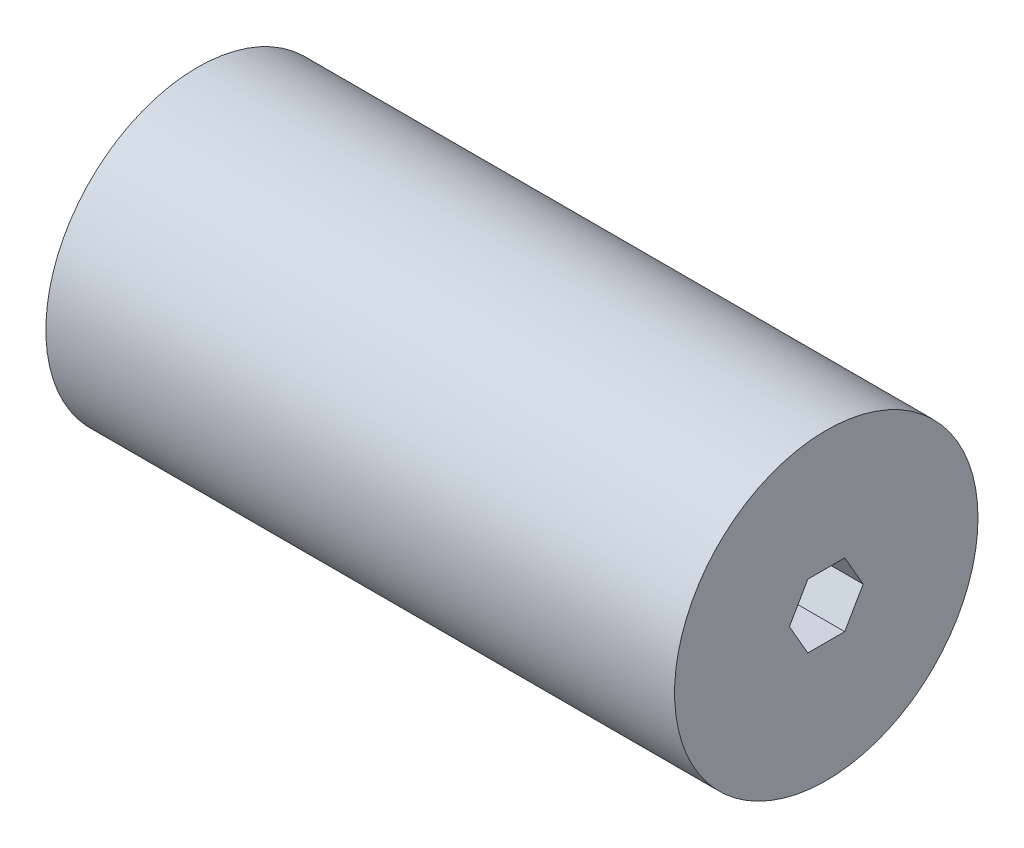
ISO-10303-21;
HEADER;
FILE_DESCRIPTION(('STEP AP214'),'2;1');
FILE_NAME('part.step','',(''),(''),'','','');
FILE_SCHEMA(('AUTOMOTIVE_DESIGN { 1 0 10303 214 1 1 1 1 }'));
ENDSEC;
DATA;
#1=APPLICATION_CONTEXT('core data for automotive mechanical design processes');
#2=APPLICATION_PROTOCOL_DEFINITION('international standard','automotive_design',2000,#1);
#3=PRODUCT_CONTEXT('',#1,'mechanical');
#4=PRODUCT('Part','Part','',(#3));
#5=PRODUCT_RELATED_PRODUCT_CATEGORY('part','',(#4));
#6=PRODUCT_DEFINITION_FORMATION('','',#4);
#7=PRODUCT_DEFINITION_CONTEXT('part definition',#1,'design');
#8=PRODUCT_DEFINITION('design','',#6,#7);
#9=PRODUCT_DEFINITION_SHAPE('','',#8);
#10=(LENGTH_UNIT() NAMED_UNIT(*) SI_UNIT(.MILLI.,.METRE.));
#11=(NAMED_UNIT(*) PLANE_ANGLE_UNIT() SI_UNIT($,.RADIAN.));
#12=(NAMED_UNIT(*) SI_UNIT($,.STERADIAN.) SOLID_ANGLE_UNIT());
#13=UNCERTAINTY_MEASURE_WITH_UNIT(LENGTH_MEASURE(1.E-05),#10,'distance_accuracy_value','');
#14=(GEOMETRIC_REPRESENTATION_CONTEXT(3) GLOBAL_UNCERTAINTY_ASSIGNED_CONTEXT((#13)) GLOBAL_UNIT_ASSIGNED_CONTEXT((#10,
#11,#12)) REPRESENTATION_CONTEXT('',''));
#15=CARTESIAN_POINT('',(0.,0.,0.));
#16=DIRECTION('',(0.,0.,1.));
#17=DIRECTION('',(1.,0.,0.));
#18=AXIS2_PLACEMENT_3D('',#15,#16,#17);
#19=CARTESIAN_POINT('',(62.5,0.,0.));
#20=DIRECTION('',(1.,0.,0.));
#21=DIRECTION('',(0.,0.,-1.));
#22=AXIS2_PLACEMENT_3D('',#19,#20,#21);
#23=PLANE('',#22);
#24=CARTESIAN_POINT('',(62.5,0.,0.));
#25=DIRECTION('',(1.,0.,0.));
#26=DIRECTION('',(0.,0.,-1.));
#27=AXIS2_PLACEMENT_3D('',#24,#25,#26);
#28=CIRCLE('',#27,30.1625);
#29=CARTESIAN_POINT('',(62.5,0.,-30.1625));
#30=VERTEX_POINT('',#29);
#31=EDGE_CURVE('E11',#30,#30,#28,.T.);
#32=ORIENTED_EDGE('',*,*,#31,.T.);
#33=EDGE_LOOP('',(#32));
#34=FACE_BOUND('',#33,.T.);
#35=DIRECTION('',(0.,0.866025403784438,0.5));
#36=VECTOR('',#35,1.);
#37=CARTESIAN_POINT('',(62.5,0.,-7.33234841870823));
#38=LINE('',#37,#36);
#39=CARTESIAN_POINT('',(62.5,0.,-7.33234841870823));
#40=VERTEX_POINT('',#39);
#41=CARTESIAN_POINT('',(62.5,6.34999999999998,-3.66617420935411));
#42=VERTEX_POINT('',#41);
#43=EDGE_CURVE('E96',#40,#42,#38,.T.);
#44=ORIENTED_EDGE('',*,*,#43,.F.);
#45=DIRECTION('',(0.,0.866025403784439,-0.499999999999999));
#46=VECTOR('',#45,1.);
#47=CARTESIAN_POINT('',(62.5,-6.34999999999999,-3.66617420935412));
#48=LINE('',#47,#46);
#49=CARTESIAN_POINT('',(62.5,-6.34999999999999,-3.66617420935412));
#50=VERTEX_POINT('',#49);
#51=EDGE_CURVE('E88',#50,#40,#48,.T.);
#52=ORIENTED_EDGE('',*,*,#51,.F.);
#53=DIRECTION('',(0.,0.,-1.));
#54=VECTOR('',#53,1.);
#55=CARTESIAN_POINT('',(62.5,-6.34999999999999,3.66617420935411));
#56=LINE('',#55,#54);
#57=CARTESIAN_POINT('',(62.5,-6.34999999999999,3.66617420935411));
#58=VERTEX_POINT('',#57);
#59=EDGE_CURVE('E116',#58,#50,#56,.T.);
#60=ORIENTED_EDGE('',*,*,#59,.F.);
#61=DIRECTION('',(0.,-0.866025403784438,-0.5));
#62=VECTOR('',#61,1.);
#63=CARTESIAN_POINT('',(62.5,0.,7.33234841870822));
#64=LINE('',#63,#62);
#65=CARTESIAN_POINT('',(62.5,0.,7.33234841870822));
#66=VERTEX_POINT('',#65);
#67=EDGE_CURVE('E114',#66,#58,#64,.T.);
#68=ORIENTED_EDGE('',*,*,#67,.F.);
#69=DIRECTION('',(0.,-0.866025403784439,0.5));
#70=VECTOR('',#69,1.);
#71=CARTESIAN_POINT('',(62.5,6.34999999999998,3.66617420935411));
#72=LINE('',#71,#70);
#73=CARTESIAN_POINT('',(62.5,6.34999999999998,3.66617420935411));
#74=VERTEX_POINT('',#73);
#75=EDGE_CURVE('E110',#74,#66,#72,.T.);
#76=ORIENTED_EDGE('',*,*,#75,.F.);
#77=DIRECTION('',(0.,0.,1.));
#78=VECTOR('',#77,1.);
#79=CARTESIAN_POINT('',(62.5,6.34999999999998,-3.66617420935411));
#80=LINE('',#79,#78);
#81=EDGE_CURVE('E108',#42,#74,#80,.T.);
#82=ORIENTED_EDGE('',*,*,#81,.F.);
#83=EDGE_LOOP('',(#44,#52,#60,#68,#76,#82));
#84=FACE_BOUND('',#83,.T.);
#85=ADVANCED_FACE('F35',(#34,#84),#23,.T.);
#86=CARTESIAN_POINT('',(-62.5,0.,0.));
#87=DIRECTION('',(1.,0.,0.));
#88=DIRECTION('',(0.,0.,-1.));
#89=AXIS2_PLACEMENT_3D('',#86,#87,#88);
#90=PLANE('',#89);
#91=CARTESIAN_POINT('',(-62.5,0.,0.));
#92=DIRECTION('',(1.,0.,0.));
#93=DIRECTION('',(0.,0.,-1.));
#94=AXIS2_PLACEMENT_3D('',#91,#92,#93);
#95=CIRCLE('',#94,30.1625);
#96=CARTESIAN_POINT('',(-62.5,0.,-30.1625));
#97=VERTEX_POINT('',#96);
#98=EDGE_CURVE('E39',#97,#97,#95,.T.);
#99=ORIENTED_EDGE('',*,*,#98,.F.);
#100=EDGE_LOOP('',(#99));
#101=FACE_BOUND('',#100,.T.);
#102=DIRECTION('',(0.,0.866025403784439,-0.499999999999999));
#103=VECTOR('',#102,1.);
#104=CARTESIAN_POINT('',(-62.5,-6.34999999999999,-3.66617420935412));
#105=LINE('',#104,#103);
#106=CARTESIAN_POINT('',(-62.5,-6.34999999999999,-3.66617420935412));
#107=VERTEX_POINT('',#106);
#108=CARTESIAN_POINT('',(-62.5,0.,-7.33234841870823));
#109=VERTEX_POINT('',#108);
#110=EDGE_CURVE('E58',#107,#109,#105,.T.);
#111=ORIENTED_EDGE('',*,*,#110,.T.);
#112=DIRECTION('',(0.,0.866025403784438,0.5));
#113=VECTOR('',#112,1.);
#114=CARTESIAN_POINT('',(-62.5,0.,-7.33234841870823));
#115=LINE('',#114,#113);
#116=CARTESIAN_POINT('',(-62.5,6.34999999999998,-3.66617420935411));
#117=VERTEX_POINT('',#116);
#118=EDGE_CURVE('E103',#109,#117,#115,.T.);
#119=ORIENTED_EDGE('',*,*,#118,.T.);
#120=DIRECTION('',(0.,0.,1.));
#121=VECTOR('',#120,1.);
#122=CARTESIAN_POINT('',(-62.5,6.34999999999998,-3.66617420935411));
#123=LINE('',#122,#121);
#124=CARTESIAN_POINT('',(-62.5,6.34999999999998,3.66617420935411));
#125=VERTEX_POINT('',#124);
#126=EDGE_CURVE('E120',#117,#125,#123,.T.);
#127=ORIENTED_EDGE('',*,*,#126,.T.);
#128=DIRECTION('',(0.,-0.866025403784439,0.5));
#129=VECTOR('',#128,1.);
#130=CARTESIAN_POINT('',(-62.5,6.34999999999998,3.66617420935411));
#131=LINE('',#130,#129);
#132=CARTESIAN_POINT('',(-62.5,0.,7.33234841870822));
#133=VERTEX_POINT('',#132);
#134=EDGE_CURVE('E123',#125,#133,#131,.T.);
#135=ORIENTED_EDGE('',*,*,#134,.T.);
#136=DIRECTION('',(0.,-0.866025403784438,-0.5));
#137=VECTOR('',#136,1.);
#138=CARTESIAN_POINT('',(-62.5,0.,7.33234841870822));
#139=LINE('',#138,#137);
#140=CARTESIAN_POINT('',(-62.5,-6.34999999999999,3.66617420935411));
#141=VERTEX_POINT('',#140);
#142=EDGE_CURVE('E126',#133,#141,#139,.T.);
#143=ORIENTED_EDGE('',*,*,#142,.T.);
#144=DIRECTION('',(0.,0.,-1.));
#145=VECTOR('',#144,1.);
#146=CARTESIAN_POINT('',(-62.5,-6.34999999999999,3.66617420935411));
#147=LINE('',#146,#145);
#148=EDGE_CURVE('E97',#141,#107,#147,.T.);
#149=ORIENTED_EDGE('',*,*,#148,.T.);
#150=EDGE_LOOP('',(#111,#119,#127,#135,#143,#149));
#151=FACE_BOUND('',#150,.T.);
#152=ADVANCED_FACE('F143',(#101,#151),#90,.F.);
#153=CARTESIAN_POINT('',(62.5,0.,0.));
#154=DIRECTION('',(-1.,0.,0.));
#155=DIRECTION('',(0.,0.,1.));
#156=AXIS2_PLACEMENT_3D('',#153,#154,#155);
#157=CYLINDRICAL_SURFACE('',#156,30.1625);
#158=ORIENTED_EDGE('',*,*,#31,.F.);
#159=EDGE_LOOP('',(#158));
#160=FACE_BOUND('',#159,.T.);
#161=ORIENTED_EDGE('',*,*,#98,.T.);
#162=EDGE_LOOP('',(#161));
#163=FACE_BOUND('',#162,.T.);
#164=ADVANCED_FACE('F37',(#160,#163),#157,.T.);
#165=CARTESIAN_POINT('',(62.5,-6.34999999999999,-3.66617420935412));
#166=DIRECTION('',(0.,0.5,0.866025403784439));
#167=DIRECTION('',(0.,-0.866025403784439,0.5));
#168=AXIS2_PLACEMENT_3D('',#165,#166,#167);
#169=PLANE('',#168);
#170=ORIENTED_EDGE('',*,*,#110,.F.);
#171=DIRECTION('',(-1.,0.,0.));
#172=VECTOR('',#171,1.);
#173=CARTESIAN_POINT('',(62.5,-6.34999999999999,-3.66617420935412));
#174=LINE('',#173,#172);
#175=EDGE_CURVE('E92',#50,#107,#174,.T.);
#176=ORIENTED_EDGE('',*,*,#175,.F.);
#177=ORIENTED_EDGE('',*,*,#51,.T.);
#178=DIRECTION('',(-1.,0.,0.));
#179=VECTOR('',#178,1.);
#180=CARTESIAN_POINT('',(62.5,0.,-7.33234841870823));
#181=LINE('',#180,#179);
#182=EDGE_CURVE('E91',#40,#109,#181,.T.);
#183=ORIENTED_EDGE('',*,*,#182,.T.);
#184=EDGE_LOOP('',(#170,#176,#177,#183));
#185=FACE_BOUND('',#184,.T.);
#186=ADVANCED_FACE('F90',(#185),#169,.T.);
#187=CARTESIAN_POINT('',(62.5,0.,-7.33234841870823));
#188=DIRECTION('',(0.,-0.5,0.866025403784439));
#189=DIRECTION('',(0.,-0.866025403784438,-0.5));
#190=AXIS2_PLACEMENT_3D('',#187,#188,#189);
#191=PLANE('',#190);
#192=ORIENTED_EDGE('',*,*,#118,.F.);
#193=ORIENTED_EDGE('',*,*,#182,.F.);
#194=ORIENTED_EDGE('',*,*,#43,.T.);
#195=DIRECTION('',(-1.,0.,0.));
#196=VECTOR('',#195,1.);
#197=CARTESIAN_POINT('',(62.5,6.34999999999998,-3.66617420935411));
#198=LINE('',#197,#196);
#199=EDGE_CURVE('E104',#42,#117,#198,.T.);
#200=ORIENTED_EDGE('',*,*,#199,.T.);
#201=EDGE_LOOP('',(#192,#193,#194,#200));
#202=FACE_BOUND('',#201,.T.);
#203=ADVANCED_FACE('F100',(#202),#191,.T.);
#204=CARTESIAN_POINT('',(62.5,6.34999999999998,-3.66617420935411));
#205=DIRECTION('',(0.,-1.,0.));
#206=DIRECTION('',(0.,0.,-1.));
#207=AXIS2_PLACEMENT_3D('',#204,#205,#206);
#208=PLANE('',#207);
#209=ORIENTED_EDGE('',*,*,#126,.F.);
#210=ORIENTED_EDGE('',*,*,#199,.F.);
#211=ORIENTED_EDGE('',*,*,#81,.T.);
#212=DIRECTION('',(-1.,0.,0.));
#213=VECTOR('',#212,1.);
#214=CARTESIAN_POINT('',(62.5,6.34999999999998,3.66617420935411));
#215=LINE('',#214,#213);
#216=EDGE_CURVE('E135',#74,#125,#215,.T.);
#217=ORIENTED_EDGE('',*,*,#216,.T.);
#218=EDGE_LOOP('',(#209,#210,#211,#217));
#219=FACE_BOUND('',#218,.T.);
#220=ADVANCED_FACE('F139',(#219),#208,.T.);
#221=CARTESIAN_POINT('',(62.5,6.34999999999998,3.66617420935411));
#222=DIRECTION('',(0.,-0.5,-0.866025403784439));
#223=DIRECTION('',(0.,0.866025403784439,-0.5));
#224=AXIS2_PLACEMENT_3D('',#221,#222,#223);
#225=PLANE('',#224);
#226=ORIENTED_EDGE('',*,*,#134,.F.);
#227=ORIENTED_EDGE('',*,*,#216,.F.);
#228=ORIENTED_EDGE('',*,*,#75,.T.);
#229=DIRECTION('',(-1.,0.,0.));
#230=VECTOR('',#229,1.);
#231=CARTESIAN_POINT('',(62.5,0.,7.33234841870822));
#232=LINE('',#231,#230);
#233=EDGE_CURVE('E133',#66,#133,#232,.T.);
#234=ORIENTED_EDGE('',*,*,#233,.T.);
#235=EDGE_LOOP('',(#226,#227,#228,#234));
#236=FACE_BOUND('',#235,.T.);
#237=ADVANCED_FACE('F151',(#236),#225,.T.);
#238=CARTESIAN_POINT('',(62.5,0.,7.33234841870822));
#239=DIRECTION('',(0.,0.5,-0.866025403784438));
#240=DIRECTION('',(0.,0.866025403784438,0.5));
#241=AXIS2_PLACEMENT_3D('',#238,#239,#240);
#242=PLANE('',#241);
#243=ORIENTED_EDGE('',*,*,#142,.F.);
#244=ORIENTED_EDGE('',*,*,#233,.F.);
#245=ORIENTED_EDGE('',*,*,#67,.T.);
#246=DIRECTION('',(-1.,0.,0.));
#247=VECTOR('',#246,1.);
#248=CARTESIAN_POINT('',(62.5,-6.34999999999999,3.66617420935411));
#249=LINE('',#248,#247);
#250=EDGE_CURVE('E50',#58,#141,#249,.T.);
#251=ORIENTED_EDGE('',*,*,#250,.T.);
#252=EDGE_LOOP('',(#243,#244,#245,#251));
#253=FACE_BOUND('',#252,.T.);
#254=ADVANCED_FACE('F149',(#253),#242,.T.);
#255=CARTESIAN_POINT('',(62.5,-6.34999999999999,3.66617420935411));
#256=DIRECTION('',(0.,1.,0.));
#257=DIRECTION('',(0.,0.,1.));
#258=AXIS2_PLACEMENT_3D('',#255,#256,#257);
#259=PLANE('',#258);
#260=ORIENTED_EDGE('',*,*,#148,.F.);
#261=ORIENTED_EDGE('',*,*,#250,.F.);
#262=ORIENTED_EDGE('',*,*,#59,.T.);
#263=ORIENTED_EDGE('',*,*,#175,.T.);
#264=EDGE_LOOP('',(#260,#261,#262,#263));
#265=FACE_BOUND('',#264,.T.);
#266=ADVANCED_FACE('F145',(#265),#259,.T.);
#267=CLOSED_SHELL('',(#85,#152,#164,#186,#203,#220,#237,#254,#266));
#268=MANIFOLD_SOLID_BREP('B2',#267);
#269=ADVANCED_BREP_SHAPE_REPRESENTATION('',(#18,#268),#14);
#270=SHAPE_DEFINITION_REPRESENTATION(#9,#269);
ENDSEC;
END-ISO-10303-21;
